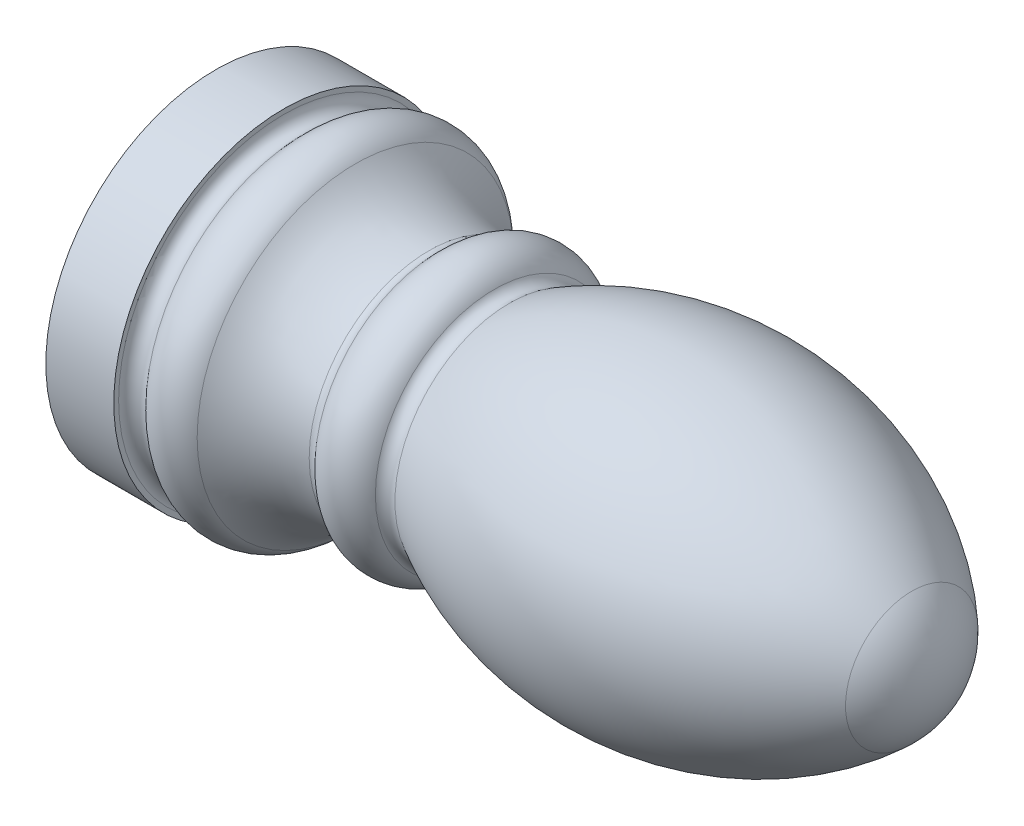
ISO-10303-21;
HEADER;
FILE_DESCRIPTION(('STEP AP214'),'2;1');
FILE_NAME('part.step','',(''),(''),'','','');
FILE_SCHEMA(('AUTOMOTIVE_DESIGN { 1 0 10303 214 1 1 1 1 }'));
ENDSEC;
DATA;
#1=APPLICATION_CONTEXT('core data for automotive mechanical design processes');
#2=APPLICATION_PROTOCOL_DEFINITION('international standard','automotive_design',2000,#1);
#3=PRODUCT_CONTEXT('',#1,'mechanical');
#4=PRODUCT('Part','Part','',(#3));
#5=PRODUCT_RELATED_PRODUCT_CATEGORY('part','',(#4));
#6=PRODUCT_DEFINITION_FORMATION('','',#4);
#7=PRODUCT_DEFINITION_CONTEXT('part definition',#1,'design');
#8=PRODUCT_DEFINITION('design','',#6,#7);
#9=PRODUCT_DEFINITION_SHAPE('','',#8);
#10=(LENGTH_UNIT() NAMED_UNIT(*) SI_UNIT(.MILLI.,.METRE.));
#11=(NAMED_UNIT(*) PLANE_ANGLE_UNIT() SI_UNIT($,.RADIAN.));
#12=(NAMED_UNIT(*) SI_UNIT($,.STERADIAN.) SOLID_ANGLE_UNIT());
#13=UNCERTAINTY_MEASURE_WITH_UNIT(LENGTH_MEASURE(1.E-05),#10,'distance_accuracy_value','');
#14=(GEOMETRIC_REPRESENTATION_CONTEXT(3) GLOBAL_UNCERTAINTY_ASSIGNED_CONTEXT((#13)) GLOBAL_UNIT_ASSIGNED_CONTEXT((#10,
#11,#12)) REPRESENTATION_CONTEXT('',''));
#15=CARTESIAN_POINT('',(0.,0.,0.));
#16=DIRECTION('',(0.,0.,1.));
#17=DIRECTION('',(1.,0.,0.));
#18=AXIS2_PLACEMENT_3D('',#15,#16,#17);
#19=CARTESIAN_POINT('',(28.,0.,0.));
#20=DIRECTION('',(1.,0.,0.));
#21=DIRECTION('',(0.,-1.,0.));
#22=AXIS2_PLACEMENT_3D('',#19,#20,#21);
#23=SPHERICAL_SURFACE('',#22,4.);
#24=CARTESIAN_POINT('',(30.7291792647684,0.,0.));
#25=DIRECTION('',(1.,0.,0.));
#26=DIRECTION('',(0.,0.,-1.));
#27=AXIS2_PLACEMENT_3D('',#24,#25,#26);
#28=CIRCLE('',#27,2.92430855772061);
#29=CARTESIAN_POINT('',(30.7291792647684,0.,-2.92430855772061));
#30=VERTEX_POINT('',#29);
#31=EDGE_CURVE('E10',#30,#30,#28,.T.);
#32=ORIENTED_EDGE('',*,*,#31,.T.);
#33=EDGE_LOOP('',(#32));
#34=FACE_BOUND('',#33,.T.);
#35=ADVANCED_FACE('F40',(#34),#23,.T.);
#36=CARTESIAN_POINT('',(20.3885814532874,0.,0.));
#37=DIRECTION('',(1.,0.,0.));
#38=DIRECTION('',(0.,0.,-1.));
#39=AXIS2_PLACEMENT_3D('',#36,#37,#38);
#40=DEGENERATE_TOROIDAL_SURFACE('',#39,8.15561538220672,15.1556153822067,.F.);
#41=ORIENTED_EDGE('',*,*,#31,.F.);
#42=EDGE_LOOP('',(#41));
#43=FACE_BOUND('',#42,.T.);
#44=CARTESIAN_POINT('',(12.9765806602382,0.,0.));
#45=DIRECTION('',(1.,0.,0.));
#46=DIRECTION('',(0.,0.,-1.));
#47=AXIS2_PLACEMENT_3D('',#44,#45,#46);
#48=CIRCLE('',#47,5.06387484462198);
#49=CARTESIAN_POINT('',(12.9765806602382,0.,-5.06387484462198));
#50=VERTEX_POINT('',#49);
#51=EDGE_CURVE('E47',#50,#50,#48,.T.);
#52=ORIENTED_EDGE('',*,*,#51,.T.);
#53=EDGE_LOOP('',(#52));
#54=FACE_BOUND('',#53,.T.);
#55=ADVANCED_FACE('F103',(#43,#54),#40,.F.);
#56=CARTESIAN_POINT('',(12.7320508075689,0.,0.));
#57=DIRECTION('',(1.,0.,0.));
#58=DIRECTION('',(0.,0.,-1.));
#59=AXIS2_PLACEMENT_3D('',#56,#57,#58);
#60=TOROIDAL_SURFACE('',#59,5.5,0.500000000000003);
#61=ORIENTED_EDGE('',*,*,#51,.F.);
#62=EDGE_LOOP('',(#61));
#63=FACE_BOUND('',#62,.T.);
#64=CARTESIAN_POINT('',(12.2990381056767,0.,0.));
#65=DIRECTION('',(1.,0.,0.));
#66=DIRECTION('',(0.,0.,-1.));
#67=AXIS2_PLACEMENT_3D('',#64,#65,#66);
#68=CIRCLE('',#67,5.25);
#69=CARTESIAN_POINT('',(12.2990381056767,0.,-5.25));
#70=VERTEX_POINT('',#69);
#71=EDGE_CURVE('E53',#70,#70,#68,.T.);
#72=ORIENTED_EDGE('',*,*,#71,.T.);
#73=EDGE_LOOP('',(#72));
#74=FACE_BOUND('',#73,.T.);
#75=ADVANCED_FACE('F107',(#63,#74),#60,.F.);
#76=CARTESIAN_POINT('',(11.,0.,0.));
#77=DIRECTION('',(1.,0.,0.));
#78=DIRECTION('',(0.,0.,-1.));
#79=AXIS2_PLACEMENT_3D('',#76,#77,#78);
#80=TOROIDAL_SURFACE('',#79,4.5,1.5);
#81=ORIENTED_EDGE('',*,*,#71,.F.);
#82=EDGE_LOOP('',(#81));
#83=FACE_BOUND('',#82,.T.);
#84=CARTESIAN_POINT('',(9.85093333532153,0.,0.));
#85=DIRECTION('',(1.,0.,0.));
#86=DIRECTION('',(0.,0.,-1.));
#87=AXIS2_PLACEMENT_3D('',#84,#85,#86);
#88=CIRCLE('',#87,5.4641814145298);
#89=CARTESIAN_POINT('',(9.85093333532153,0.,-5.4641814145298));
#90=VERTEX_POINT('',#89);
#91=EDGE_CURVE('E59',#90,#90,#88,.T.);
#92=ORIENTED_EDGE('',*,*,#91,.T.);
#93=EDGE_LOOP('',(#92));
#94=FACE_BOUND('',#93,.T.);
#95=ADVANCED_FACE('F112',(#83,#94),#80,.T.);
#96=CARTESIAN_POINT('',(9.46791111376204,0.,0.));
#97=DIRECTION('',(1.,0.,0.));
#98=DIRECTION('',(0.,0.,-1.));
#99=AXIS2_PLACEMENT_3D('',#96,#97,#98);
#100=TOROIDAL_SURFACE('',#99,5.78557521937307,0.500000000000001);
#101=ORIENTED_EDGE('',*,*,#91,.F.);
#102=EDGE_LOOP('',(#101));
#103=FACE_BOUND('',#102,.T.);
#104=CARTESIAN_POINT('',(9.41535122075844,0.,0.));
#105=DIRECTION('',(1.,0.,0.));
#106=DIRECTION('',(0.,0.,-1.));
#107=AXIS2_PLACEMENT_3D('',#104,#105,#106);
#108=CIRCLE('',#107,5.28834543582481);
#109=CARTESIAN_POINT('',(9.41535122075844,0.,-5.28834543582481));
#110=VERTEX_POINT('',#109);
#111=EDGE_CURVE('E65',#110,#110,#108,.T.);
#112=ORIENTED_EDGE('',*,*,#111,.T.);
#113=EDGE_LOOP('',(#112));
#114=FACE_BOUND('',#113,.T.);
#115=ADVANCED_FACE('F118',(#103,#114),#100,.F.);
#116=CARTESIAN_POINT('',(9.94095015079443,0.,0.));
#117=DIRECTION('',(1.,0.,0.));
#118=DIRECTION('',(0.,0.,-1.));
#119=AXIS2_PLACEMENT_3D('',#116,#117,#118);
#120=TOROIDAL_SURFACE('',#119,10.2606432713074,5.);
#121=ORIENTED_EDGE('',*,*,#111,.F.);
#122=EDGE_LOOP('',(#121));
#123=FACE_BOUND('',#122,.T.);
#124=CARTESIAN_POINT('',(6.16490302421253,0.,0.));
#125=DIRECTION('',(1.,0.,0.));
#126=DIRECTION('',(0.,0.,-1.));
#127=AXIS2_PLACEMENT_3D('',#124,#125,#126);
#128=CIRCLE('',#127,6.98322537030171);
#129=CARTESIAN_POINT('',(6.16490302421253,0.,-6.98322537030171));
#130=VERTEX_POINT('',#129);
#131=EDGE_CURVE('E69',#130,#130,#128,.T.);
#132=ORIENTED_EDGE('',*,*,#131,.T.);
#133=EDGE_LOOP('',(#132));
#134=FACE_BOUND('',#133,.T.);
#135=ADVANCED_FACE('F122',(#123,#134),#120,.F.);
#136=CARTESIAN_POINT('',(5.03208888623796,0.,0.));
#137=DIRECTION('',(1.,0.,0.));
#138=DIRECTION('',(0.,0.,-1.));
#139=AXIS2_PLACEMENT_3D('',#136,#137,#138);
#140=TOROIDAL_SURFACE('',#139,6.,1.5);
#141=ORIENTED_EDGE('',*,*,#131,.F.);
#142=EDGE_LOOP('',(#141));
#143=FACE_BOUND('',#142,.T.);
#144=CARTESIAN_POINT('',(3.88302222155949,0.,0.));
#145=DIRECTION('',(1.,0.,0.));
#146=DIRECTION('',(0.,0.,-1.));
#147=AXIS2_PLACEMENT_3D('',#144,#145,#146);
#148=CIRCLE('',#147,6.9641814145298);
#149=CARTESIAN_POINT('',(3.88302222155949,0.,-6.9641814145298));
#150=VERTEX_POINT('',#149);
#151=EDGE_CURVE('E73',#150,#150,#148,.T.);
#152=ORIENTED_EDGE('',*,*,#151,.T.);
#153=EDGE_LOOP('',(#152));
#154=FACE_BOUND('',#153,.T.);
#155=ADVANCED_FACE('F126',(#143,#154),#140,.T.);
#156=CARTESIAN_POINT('',(3.5,0.,0.));
#157=DIRECTION('',(1.,0.,0.));
#158=DIRECTION('',(0.,0.,-1.));
#159=AXIS2_PLACEMENT_3D('',#156,#157,#158);
#160=TOROIDAL_SURFACE('',#159,7.28557521937307,0.5);
#161=ORIENTED_EDGE('',*,*,#151,.F.);
#162=EDGE_LOOP('',(#161));
#163=FACE_BOUND('',#162,.T.);
#164=CARTESIAN_POINT('',(3.,0.,0.));
#165=DIRECTION('',(1.,0.,0.));
#166=DIRECTION('',(0.,0.,-1.));
#167=AXIS2_PLACEMENT_3D('',#164,#165,#166);
#168=CIRCLE('',#167,7.28557521937307);
#169=CARTESIAN_POINT('',(3.,0.,-7.28557521937307));
#170=VERTEX_POINT('',#169);
#171=EDGE_CURVE('E77',#170,#170,#168,.T.);
#172=ORIENTED_EDGE('',*,*,#171,.T.);
#173=EDGE_LOOP('',(#172));
#174=FACE_BOUND('',#173,.T.);
#175=ADVANCED_FACE('F130',(#163,#174),#160,.F.);
#176=CARTESIAN_POINT('',(3.,-7.5,0.));
#177=DIRECTION('',(-1.,0.,0.));
#178=DIRECTION('',(0.,0.,1.));
#179=AXIS2_PLACEMENT_3D('',#176,#177,#178);
#180=PLANE('',#179);
#181=ORIENTED_EDGE('',*,*,#171,.F.);
#182=EDGE_LOOP('',(#181));
#183=FACE_BOUND('',#182,.T.);
#184=CARTESIAN_POINT('',(3.,0.,0.));
#185=DIRECTION('',(1.,0.,0.));
#186=DIRECTION('',(0.,0.,-1.));
#187=AXIS2_PLACEMENT_3D('',#184,#185,#186);
#188=CIRCLE('',#187,7.5);
#189=CARTESIAN_POINT('',(3.,0.,-7.5));
#190=VERTEX_POINT('',#189);
#191=EDGE_CURVE('E81',#190,#190,#188,.T.);
#192=ORIENTED_EDGE('',*,*,#191,.T.);
#193=EDGE_LOOP('',(#192));
#194=FACE_BOUND('',#193,.T.);
#195=ADVANCED_FACE('F99',(#183,#194),#180,.F.);
#196=CARTESIAN_POINT('',(0.,0.,0.));
#197=DIRECTION('',(1.,0.,0.));
#198=DIRECTION('',(0.,0.,-1.));
#199=AXIS2_PLACEMENT_3D('',#196,#197,#198);
#200=CYLINDRICAL_SURFACE('',#199,7.5);
#201=ORIENTED_EDGE('',*,*,#191,.F.);
#202=EDGE_LOOP('',(#201));
#203=FACE_BOUND('',#202,.T.);
#204=CARTESIAN_POINT('',(0.,0.,0.));
#205=DIRECTION('',(1.,0.,0.));
#206=DIRECTION('',(0.,0.,-1.));
#207=AXIS2_PLACEMENT_3D('',#204,#205,#206);
#208=CIRCLE('',#207,7.5);
#209=CARTESIAN_POINT('',(0.,0.,-7.5));
#210=VERTEX_POINT('',#209);
#211=EDGE_CURVE('E85',#210,#210,#208,.T.);
#212=ORIENTED_EDGE('',*,*,#211,.T.);
#213=EDGE_LOOP('',(#212));
#214=FACE_BOUND('',#213,.T.);
#215=ADVANCED_FACE('F91',(#203,#214),#200,.T.);
#216=CARTESIAN_POINT('',(0.,0.,0.));
#217=DIRECTION('',(1.,0.,0.));
#218=DIRECTION('',(0.,0.,-1.));
#219=AXIS2_PLACEMENT_3D('',#216,#217,#218);
#220=PLANE('',#219);
#221=ORIENTED_EDGE('',*,*,#211,.F.);
#222=EDGE_LOOP('',(#221));
#223=FACE_BOUND('',#222,.T.);
#224=ADVANCED_FACE('F93',(#223),#220,.F.);
#225=CLOSED_SHELL('',(#35,#55,#75,#95,#115,#135,#155,#175,#195,#215,#224));
#226=MANIFOLD_SOLID_BREP('B2',#225);
#227=ADVANCED_BREP_SHAPE_REPRESENTATION('',(#18,#226),#14);
#228=SHAPE_DEFINITION_REPRESENTATION(#9,#227);
ENDSEC;
END-ISO-10303-21;
